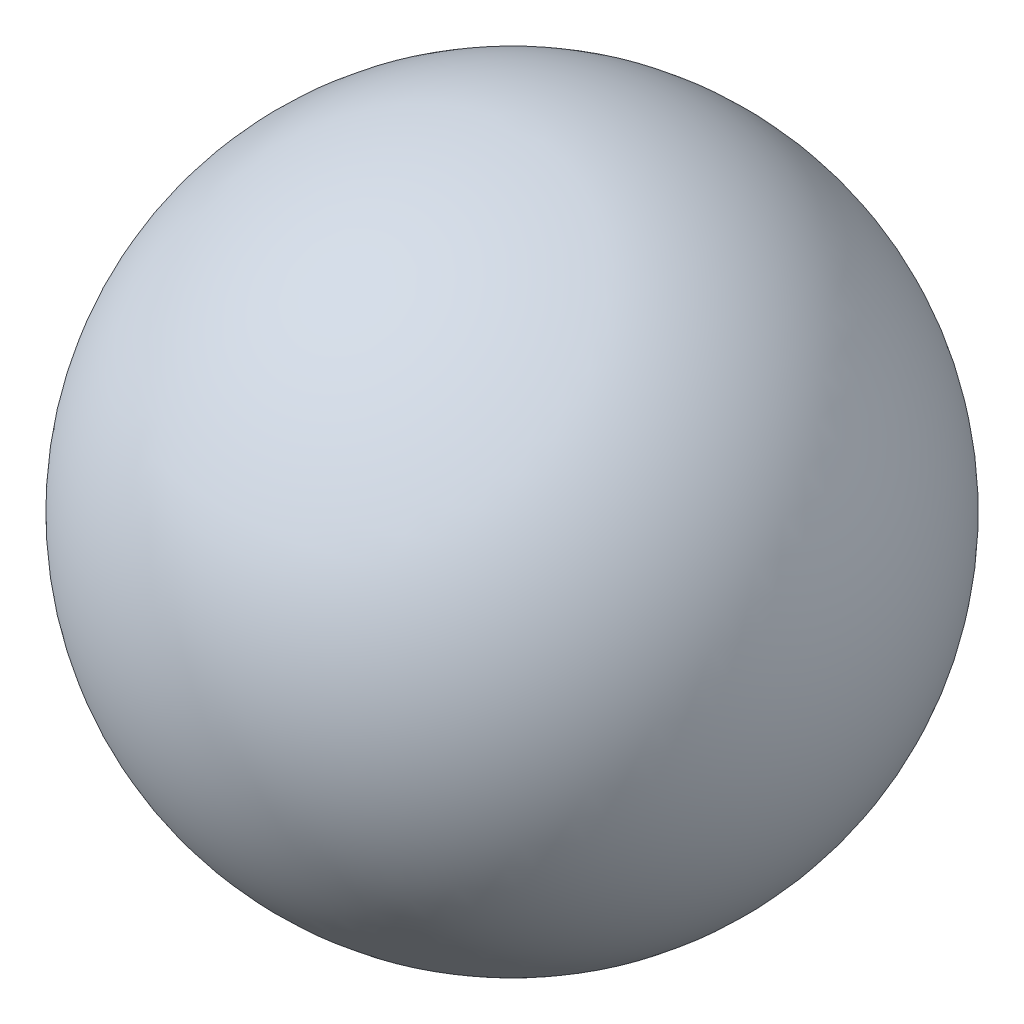
ISO-10303-21;
HEADER;
FILE_DESCRIPTION(('STEP AP214'),'2;1');
FILE_NAME('part.step','',(''),(''),'','','');
FILE_SCHEMA(('AUTOMOTIVE_DESIGN { 1 0 10303 214 1 1 1 1 }'));
ENDSEC;
DATA;
#1=APPLICATION_CONTEXT('core data for automotive mechanical design processes');
#2=APPLICATION_PROTOCOL_DEFINITION('international standard','automotive_design',2000,#1);
#3=PRODUCT_CONTEXT('',#1,'mechanical');
#4=PRODUCT('Part','Part','',(#3));
#5=PRODUCT_RELATED_PRODUCT_CATEGORY('part','',(#4));
#6=PRODUCT_DEFINITION_FORMATION('','',#4);
#7=PRODUCT_DEFINITION_CONTEXT('part definition',#1,'design');
#8=PRODUCT_DEFINITION('design','',#6,#7);
#9=PRODUCT_DEFINITION_SHAPE('','',#8);
#10=(LENGTH_UNIT() NAMED_UNIT(*) SI_UNIT(.MILLI.,.METRE.));
#11=(NAMED_UNIT(*) PLANE_ANGLE_UNIT() SI_UNIT($,.RADIAN.));
#12=(NAMED_UNIT(*) SI_UNIT($,.STERADIAN.) SOLID_ANGLE_UNIT());
#13=UNCERTAINTY_MEASURE_WITH_UNIT(LENGTH_MEASURE(1.E-05),#10,'distance_accuracy_value','');
#14=(GEOMETRIC_REPRESENTATION_CONTEXT(3) GLOBAL_UNCERTAINTY_ASSIGNED_CONTEXT((#13)) GLOBAL_UNIT_ASSIGNED_CONTEXT((#10,
#11,#12)) REPRESENTATION_CONTEXT('',''));
#15=CARTESIAN_POINT('',(0.,0.,0.));
#16=DIRECTION('',(0.,0.,1.));
#17=DIRECTION('',(1.,0.,0.));
#18=AXIS2_PLACEMENT_3D('',#15,#16,#17);
#19=CARTESIAN_POINT('',(0.,0.,0.));
#20=DIRECTION('',(0.,-1.,0.));
#21=DIRECTION('',(0.,0.,1.));
#22=AXIS2_PLACEMENT_3D('',#19,#20,#21);
#23=SPHERICAL_SURFACE('',#22,22.);
#24=CARTESIAN_POINT('',(0.,-22.,0.));
#25=VERTEX_POINT('',#24);
#26=VERTEX_LOOP('',#25);
#27=FACE_BOUND('',#26,.T.);
#28=ADVANCED_FACE('F35',(#27),#23,.T.);
#29=CLOSED_SHELL('',(#28));
#30=MANIFOLD_SOLID_BREP('B2',#29);
#31=ADVANCED_BREP_SHAPE_REPRESENTATION('',(#18,#30),#14);
#32=SHAPE_DEFINITION_REPRESENTATION(#9,#31);
ENDSEC;
END-ISO-10303-21;
